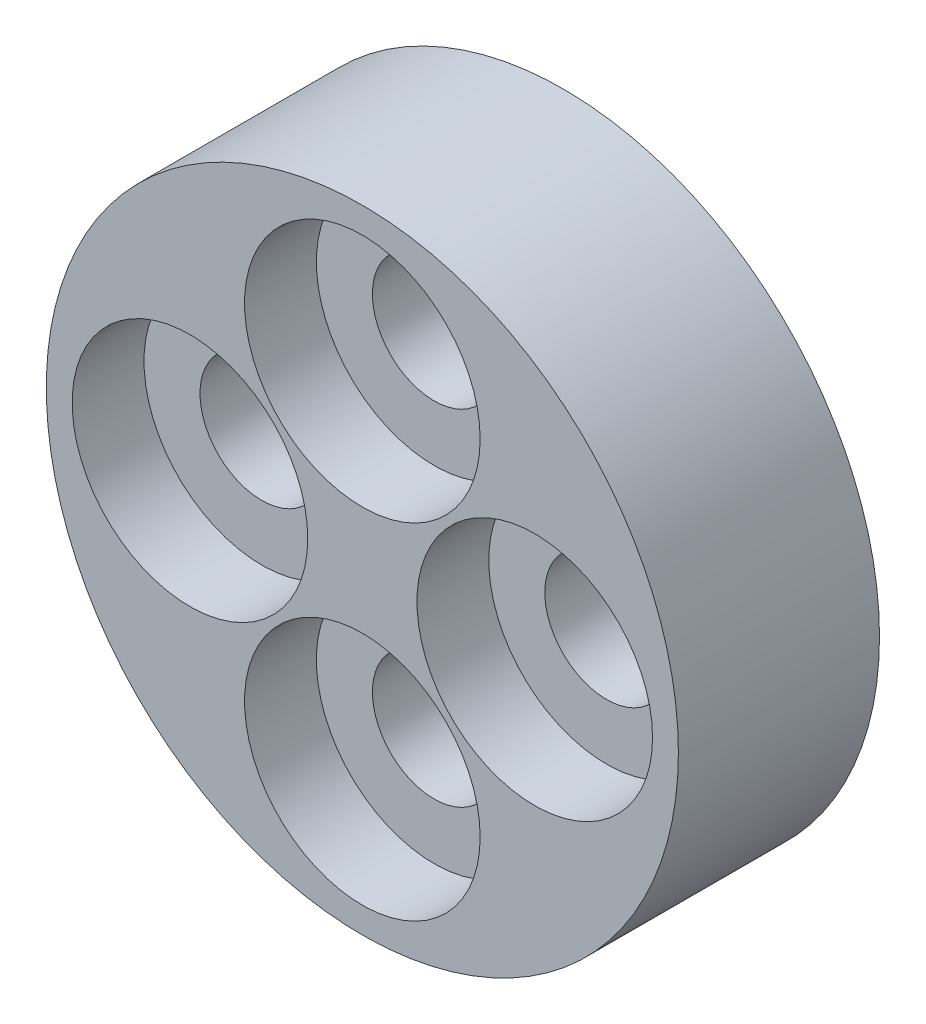
ISO-10303-21;
HEADER;
FILE_DESCRIPTION(('STEP AP214'),'2;1');
FILE_NAME('part.step','',(''),(''),'','','');
FILE_SCHEMA(('AUTOMOTIVE_DESIGN { 1 0 10303 214 1 1 1 1 }'));
ENDSEC;
DATA;
#1=APPLICATION_CONTEXT('core data for automotive mechanical design processes');
#2=APPLICATION_PROTOCOL_DEFINITION('international standard','automotive_design',2000,#1);
#3=PRODUCT_CONTEXT('',#1,'mechanical');
#4=PRODUCT('Part','Part','',(#3));
#5=PRODUCT_RELATED_PRODUCT_CATEGORY('part','',(#4));
#6=PRODUCT_DEFINITION_FORMATION('','',#4);
#7=PRODUCT_DEFINITION_CONTEXT('part definition',#1,'design');
#8=PRODUCT_DEFINITION('design','',#6,#7);
#9=PRODUCT_DEFINITION_SHAPE('','',#8);
#10=(LENGTH_UNIT() NAMED_UNIT(*) SI_UNIT(.MILLI.,.METRE.));
#11=(NAMED_UNIT(*) PLANE_ANGLE_UNIT() SI_UNIT($,.RADIAN.));
#12=(NAMED_UNIT(*) SI_UNIT($,.STERADIAN.) SOLID_ANGLE_UNIT());
#13=UNCERTAINTY_MEASURE_WITH_UNIT(LENGTH_MEASURE(1.E-05),#10,'distance_accuracy_value','');
#14=(GEOMETRIC_REPRESENTATION_CONTEXT(3) GLOBAL_UNCERTAINTY_ASSIGNED_CONTEXT((#13)) GLOBAL_UNIT_ASSIGNED_CONTEXT((#10,
#11,#12)) REPRESENTATION_CONTEXT('',''));
#15=CARTESIAN_POINT('',(0.,0.,0.));
#16=DIRECTION('',(0.,0.,1.));
#17=DIRECTION('',(1.,0.,0.));
#18=AXIS2_PLACEMENT_3D('',#15,#16,#17);
#19=CARTESIAN_POINT('',(0.,0.,7.));
#20=DIRECTION('',(0.,0.,-1.));
#21=DIRECTION('',(-1.,0.,0.));
#22=AXIS2_PLACEMENT_3D('',#19,#20,#21);
#23=CYLINDRICAL_SURFACE('',#22,11.);
#24=CARTESIAN_POINT('',(0.,0.,7.));
#25=DIRECTION('',(0.,0.,1.));
#26=DIRECTION('',(1.,0.,0.));
#27=AXIS2_PLACEMENT_3D('',#24,#25,#26);
#28=CIRCLE('',#27,11.);
#29=CARTESIAN_POINT('',(11.,0.,7.));
#30=VERTEX_POINT('',#29);
#31=EDGE_CURVE('E10',#30,#30,#28,.T.);
#32=ORIENTED_EDGE('',*,*,#31,.F.);
#33=EDGE_LOOP('',(#32));
#34=FACE_BOUND('',#33,.T.);
#35=CARTESIAN_POINT('',(0.,0.,0.));
#36=DIRECTION('',(0.,0.,1.));
#37=DIRECTION('',(1.,0.,0.));
#38=AXIS2_PLACEMENT_3D('',#35,#36,#37);
#39=CIRCLE('',#38,11.);
#40=CARTESIAN_POINT('',(11.,0.,0.));
#41=VERTEX_POINT('',#40);
#42=EDGE_CURVE('E40',#41,#41,#39,.T.);
#43=ORIENTED_EDGE('',*,*,#42,.T.);
#44=EDGE_LOOP('',(#43));
#45=FACE_BOUND('',#44,.T.);
#46=ADVANCED_FACE('F33',(#34,#45),#23,.T.);
#47=CARTESIAN_POINT('',(0.,0.,7.));
#48=DIRECTION('',(0.,0.,1.));
#49=DIRECTION('',(1.,0.,0.));
#50=AXIS2_PLACEMENT_3D('',#47,#48,#49);
#51=PLANE('',#50);
#52=CARTESIAN_POINT('',(0.,-6.,7.));
#53=DIRECTION('',(0.,0.,1.));
#54=DIRECTION('',(1.,0.,0.));
#55=AXIS2_PLACEMENT_3D('',#52,#53,#54);
#56=CIRCLE('',#55,4.1);
#57=CARTESIAN_POINT('',(4.1,-6.,7.));
#58=VERTEX_POINT('',#57);
#59=EDGE_CURVE('E71',#58,#58,#56,.T.);
#60=ORIENTED_EDGE('',*,*,#59,.F.);
#61=EDGE_LOOP('',(#60));
#62=FACE_BOUND('',#61,.T.);
#63=CARTESIAN_POINT('',(6.,0.,7.));
#64=DIRECTION('',(0.,0.,1.));
#65=DIRECTION('',(1.,0.,0.));
#66=AXIS2_PLACEMENT_3D('',#63,#64,#65);
#67=CIRCLE('',#66,4.1);
#68=CARTESIAN_POINT('',(10.1,0.,7.));
#69=VERTEX_POINT('',#68);
#70=EDGE_CURVE('E78',#69,#69,#67,.T.);
#71=ORIENTED_EDGE('',*,*,#70,.F.);
#72=EDGE_LOOP('',(#71));
#73=FACE_BOUND('',#72,.T.);
#74=CARTESIAN_POINT('',(-6.,0.,7.));
#75=DIRECTION('',(0.,0.,1.));
#76=DIRECTION('',(1.,0.,0.));
#77=AXIS2_PLACEMENT_3D('',#74,#75,#76);
#78=CIRCLE('',#77,4.1);
#79=CARTESIAN_POINT('',(-1.9,0.,7.));
#80=VERTEX_POINT('',#79);
#81=EDGE_CURVE('E62',#80,#80,#78,.T.);
#82=ORIENTED_EDGE('',*,*,#81,.F.);
#83=EDGE_LOOP('',(#82));
#84=FACE_BOUND('',#83,.T.);
#85=CARTESIAN_POINT('',(0.,6.,7.));
#86=DIRECTION('',(0.,0.,1.));
#87=DIRECTION('',(1.,0.,0.));
#88=AXIS2_PLACEMENT_3D('',#85,#86,#87);
#89=CIRCLE('',#88,4.1);
#90=CARTESIAN_POINT('',(4.1,6.,7.));
#91=VERTEX_POINT('',#90);
#92=EDGE_CURVE('E48',#91,#91,#89,.T.);
#93=ORIENTED_EDGE('',*,*,#92,.F.);
#94=EDGE_LOOP('',(#93));
#95=FACE_BOUND('',#94,.T.);
#96=ORIENTED_EDGE('',*,*,#31,.T.);
#97=EDGE_LOOP('',(#96));
#98=FACE_BOUND('',#97,.T.);
#99=ADVANCED_FACE('F93',(#62,#73,#84,#95,#98),#51,.T.);
#100=CARTESIAN_POINT('',(0.,0.,0.));
#101=DIRECTION('',(0.,0.,1.));
#102=DIRECTION('',(1.,0.,0.));
#103=AXIS2_PLACEMENT_3D('',#100,#101,#102);
#104=PLANE('',#103);
#105=CARTESIAN_POINT('',(0.,-6.,0.));
#106=DIRECTION('',(0.,0.,1.));
#107=DIRECTION('',(1.,0.,0.));
#108=AXIS2_PLACEMENT_3D('',#105,#106,#107);
#109=CIRCLE('',#108,2.15);
#110=CARTESIAN_POINT('',(2.15,-6.,0.));
#111=VERTEX_POINT('',#110);
#112=EDGE_CURVE('E36',#111,#111,#109,.T.);
#113=ORIENTED_EDGE('',*,*,#112,.T.);
#114=EDGE_LOOP('',(#113));
#115=FACE_BOUND('',#114,.T.);
#116=CARTESIAN_POINT('',(-6.,0.,0.));
#117=DIRECTION('',(0.,0.,1.));
#118=DIRECTION('',(1.,0.,0.));
#119=AXIS2_PLACEMENT_3D('',#116,#117,#118);
#120=CIRCLE('',#119,2.15);
#121=CARTESIAN_POINT('',(-3.85,0.,0.));
#122=VERTEX_POINT('',#121);
#123=EDGE_CURVE('E57',#122,#122,#120,.T.);
#124=ORIENTED_EDGE('',*,*,#123,.T.);
#125=EDGE_LOOP('',(#124));
#126=FACE_BOUND('',#125,.T.);
#127=CARTESIAN_POINT('',(0.,6.,0.));
#128=DIRECTION('',(0.,0.,1.));
#129=DIRECTION('',(1.,0.,0.));
#130=AXIS2_PLACEMENT_3D('',#127,#128,#129);
#131=CIRCLE('',#130,2.15);
#132=CARTESIAN_POINT('',(2.15000000000004,6.,0.));
#133=VERTEX_POINT('',#132);
#134=EDGE_CURVE('E54',#133,#133,#131,.T.);
#135=ORIENTED_EDGE('',*,*,#134,.T.);
#136=EDGE_LOOP('',(#135));
#137=FACE_BOUND('',#136,.T.);
#138=CARTESIAN_POINT('',(6.,0.,0.));
#139=DIRECTION('',(0.,0.,1.));
#140=DIRECTION('',(1.,0.,0.));
#141=AXIS2_PLACEMENT_3D('',#138,#139,#140);
#142=CIRCLE('',#141,2.15);
#143=CARTESIAN_POINT('',(8.15,0.,0.));
#144=VERTEX_POINT('',#143);
#145=EDGE_CURVE('E51',#144,#144,#142,.T.);
#146=ORIENTED_EDGE('',*,*,#145,.T.);
#147=EDGE_LOOP('',(#146));
#148=FACE_BOUND('',#147,.T.);
#149=ORIENTED_EDGE('',*,*,#42,.F.);
#150=EDGE_LOOP('',(#149));
#151=FACE_BOUND('',#150,.T.);
#152=ADVANCED_FACE('F95',(#115,#126,#137,#148,#151),#104,.F.);
#153=CARTESIAN_POINT('',(0.,6.,4.5));
#154=DIRECTION('',(0.,0.,1.));
#155=DIRECTION('',(1.,0.,0.));
#156=AXIS2_PLACEMENT_3D('',#153,#154,#155);
#157=CYLINDRICAL_SURFACE('',#156,4.1);
#158=CARTESIAN_POINT('',(0.,6.,4.5));
#159=DIRECTION('',(0.,0.,1.));
#160=DIRECTION('',(1.,0.,0.));
#161=AXIS2_PLACEMENT_3D('',#158,#159,#160);
#162=CIRCLE('',#161,4.1);
#163=CARTESIAN_POINT('',(4.1,6.,4.5));
#164=VERTEX_POINT('',#163);
#165=EDGE_CURVE('E45',#164,#164,#162,.T.);
#166=ORIENTED_EDGE('',*,*,#165,.F.);
#167=EDGE_LOOP('',(#166));
#168=FACE_BOUND('',#167,.T.);
#169=ORIENTED_EDGE('',*,*,#92,.T.);
#170=EDGE_LOOP('',(#169));
#171=FACE_BOUND('',#170,.T.);
#172=ADVANCED_FACE('F91',(#168,#171),#157,.F.);
#173=CARTESIAN_POINT('',(0.,6.,4.5));
#174=DIRECTION('',(0.,0.,1.));
#175=DIRECTION('',(1.,0.,0.));
#176=AXIS2_PLACEMENT_3D('',#173,#174,#175);
#177=PLANE('',#176);
#178=CARTESIAN_POINT('',(0.,6.,4.5));
#179=DIRECTION('',(0.,0.,1.));
#180=DIRECTION('',(1.,0.,0.));
#181=AXIS2_PLACEMENT_3D('',#178,#179,#180);
#182=CIRCLE('',#181,2.15);
#183=CARTESIAN_POINT('',(2.15000000000004,6.,4.5));
#184=VERTEX_POINT('',#183);
#185=EDGE_CURVE('E160',#184,#184,#182,.T.);
#186=ORIENTED_EDGE('',*,*,#185,.F.);
#187=EDGE_LOOP('',(#186));
#188=FACE_BOUND('',#187,.T.);
#189=ORIENTED_EDGE('',*,*,#165,.T.);
#190=EDGE_LOOP('',(#189));
#191=FACE_BOUND('',#190,.T.);
#192=ADVANCED_FACE('F108',(#188,#191),#177,.T.);
#193=CARTESIAN_POINT('',(-6.,0.,4.5));
#194=DIRECTION('',(0.,0.,1.));
#195=DIRECTION('',(1.,0.,0.));
#196=AXIS2_PLACEMENT_3D('',#193,#194,#195);
#197=CYLINDRICAL_SURFACE('',#196,4.1);
#198=CARTESIAN_POINT('',(-6.,0.,4.5));
#199=DIRECTION('',(0.,0.,1.));
#200=DIRECTION('',(1.,0.,0.));
#201=AXIS2_PLACEMENT_3D('',#198,#199,#200);
#202=CIRCLE('',#201,4.1);
#203=CARTESIAN_POINT('',(-1.9,0.,4.5));
#204=VERTEX_POINT('',#203);
#205=EDGE_CURVE('E66',#204,#204,#202,.T.);
#206=ORIENTED_EDGE('',*,*,#205,.F.);
#207=EDGE_LOOP('',(#206));
#208=FACE_BOUND('',#207,.T.);
#209=ORIENTED_EDGE('',*,*,#81,.T.);
#210=EDGE_LOOP('',(#209));
#211=FACE_BOUND('',#210,.T.);
#212=ADVANCED_FACE('F112',(#208,#211),#197,.F.);
#213=CARTESIAN_POINT('',(-6.,0.,4.5));
#214=DIRECTION('',(0.,0.,1.));
#215=DIRECTION('',(1.,0.,0.));
#216=AXIS2_PLACEMENT_3D('',#213,#214,#215);
#217=PLANE('',#216);
#218=CARTESIAN_POINT('',(-6.,0.,4.5));
#219=DIRECTION('',(0.,0.,1.));
#220=DIRECTION('',(1.,0.,0.));
#221=AXIS2_PLACEMENT_3D('',#218,#219,#220);
#222=CIRCLE('',#221,2.15);
#223=CARTESIAN_POINT('',(-3.85,0.,4.5));
#224=VERTEX_POINT('',#223);
#225=EDGE_CURVE('E157',#224,#224,#222,.T.);
#226=ORIENTED_EDGE('',*,*,#225,.F.);
#227=EDGE_LOOP('',(#226));
#228=FACE_BOUND('',#227,.T.);
#229=ORIENTED_EDGE('',*,*,#205,.T.);
#230=EDGE_LOOP('',(#229));
#231=FACE_BOUND('',#230,.T.);
#232=ADVANCED_FACE('F118',(#228,#231),#217,.T.);
#233=CARTESIAN_POINT('',(6.,0.,4.5));
#234=DIRECTION('',(0.,0.,1.));
#235=DIRECTION('',(1.,0.,0.));
#236=AXIS2_PLACEMENT_3D('',#233,#234,#235);
#237=CYLINDRICAL_SURFACE('',#236,4.1);
#238=CARTESIAN_POINT('',(6.,0.,4.5));
#239=DIRECTION('',(0.,0.,1.));
#240=DIRECTION('',(1.,0.,0.));
#241=AXIS2_PLACEMENT_3D('',#238,#239,#240);
#242=CIRCLE('',#241,4.1);
#243=CARTESIAN_POINT('',(10.1,0.,4.5));
#244=VERTEX_POINT('',#243);
#245=EDGE_CURVE('E81',#244,#244,#242,.T.);
#246=ORIENTED_EDGE('',*,*,#245,.F.);
#247=EDGE_LOOP('',(#246));
#248=FACE_BOUND('',#247,.T.);
#249=ORIENTED_EDGE('',*,*,#70,.T.);
#250=EDGE_LOOP('',(#249));
#251=FACE_BOUND('',#250,.T.);
#252=ADVANCED_FACE('F114',(#248,#251),#237,.F.);
#253=CARTESIAN_POINT('',(6.,0.,4.5));
#254=DIRECTION('',(0.,0.,1.));
#255=DIRECTION('',(1.,0.,0.));
#256=AXIS2_PLACEMENT_3D('',#253,#254,#255);
#257=PLANE('',#256);
#258=CARTESIAN_POINT('',(6.,0.,4.5));
#259=DIRECTION('',(0.,0.,1.));
#260=DIRECTION('',(1.,0.,0.));
#261=AXIS2_PLACEMENT_3D('',#258,#259,#260);
#262=CIRCLE('',#261,2.15);
#263=CARTESIAN_POINT('',(8.15,0.,4.5));
#264=VERTEX_POINT('',#263);
#265=EDGE_CURVE('E164',#264,#264,#262,.T.);
#266=ORIENTED_EDGE('',*,*,#265,.F.);
#267=EDGE_LOOP('',(#266));
#268=FACE_BOUND('',#267,.T.);
#269=ORIENTED_EDGE('',*,*,#245,.T.);
#270=EDGE_LOOP('',(#269));
#271=FACE_BOUND('',#270,.T.);
#272=ADVANCED_FACE('F117',(#268,#271),#257,.T.);
#273=CARTESIAN_POINT('',(0.,-6.,4.5));
#274=DIRECTION('',(0.,0.,1.));
#275=DIRECTION('',(1.,0.,0.));
#276=AXIS2_PLACEMENT_3D('',#273,#274,#275);
#277=CYLINDRICAL_SURFACE('',#276,4.1);
#278=CARTESIAN_POINT('',(0.,-6.,4.5));
#279=DIRECTION('',(0.,0.,1.));
#280=DIRECTION('',(1.,0.,0.));
#281=AXIS2_PLACEMENT_3D('',#278,#279,#280);
#282=CIRCLE('',#281,4.1);
#283=CARTESIAN_POINT('',(4.1,-6.,4.5));
#284=VERTEX_POINT('',#283);
#285=EDGE_CURVE('E75',#284,#284,#282,.T.);
#286=ORIENTED_EDGE('',*,*,#285,.F.);
#287=EDGE_LOOP('',(#286));
#288=FACE_BOUND('',#287,.T.);
#289=ORIENTED_EDGE('',*,*,#59,.T.);
#290=EDGE_LOOP('',(#289));
#291=FACE_BOUND('',#290,.T.);
#292=ADVANCED_FACE('F122',(#288,#291),#277,.F.);
#293=CARTESIAN_POINT('',(0.,-6.,4.5));
#294=DIRECTION('',(0.,0.,1.));
#295=DIRECTION('',(1.,0.,0.));
#296=AXIS2_PLACEMENT_3D('',#293,#294,#295);
#297=PLANE('',#296);
#298=CARTESIAN_POINT('',(0.,-6.,4.5));
#299=DIRECTION('',(0.,0.,1.));
#300=DIRECTION('',(1.,0.,0.));
#301=AXIS2_PLACEMENT_3D('',#298,#299,#300);
#302=CIRCLE('',#301,2.15);
#303=CARTESIAN_POINT('',(2.15,-6.,4.5));
#304=VERTEX_POINT('',#303);
#305=EDGE_CURVE('E55',#304,#304,#302,.T.);
#306=ORIENTED_EDGE('',*,*,#305,.F.);
#307=EDGE_LOOP('',(#306));
#308=FACE_BOUND('',#307,.T.);
#309=ORIENTED_EDGE('',*,*,#285,.T.);
#310=EDGE_LOOP('',(#309));
#311=FACE_BOUND('',#310,.T.);
#312=ADVANCED_FACE('F126',(#308,#311),#297,.T.);
#313=CARTESIAN_POINT('',(6.,0.,-5.5));
#314=DIRECTION('',(0.,0.,1.));
#315=DIRECTION('',(1.,0.,0.));
#316=AXIS2_PLACEMENT_3D('',#313,#314,#315);
#317=CYLINDRICAL_SURFACE('',#316,2.15);
#318=ORIENTED_EDGE('',*,*,#265,.T.);
#319=EDGE_LOOP('',(#318));
#320=FACE_BOUND('',#319,.T.);
#321=ORIENTED_EDGE('',*,*,#145,.F.);
#322=EDGE_LOOP('',(#321));
#323=FACE_BOUND('',#322,.T.);
#324=ADVANCED_FACE('F130',(#320,#323),#317,.F.);
#325=CARTESIAN_POINT('',(0.,6.,-5.5));
#326=DIRECTION('',(0.,0.,1.));
#327=DIRECTION('',(1.,0.,0.));
#328=AXIS2_PLACEMENT_3D('',#325,#326,#327);
#329=CYLINDRICAL_SURFACE('',#328,2.15);
#330=ORIENTED_EDGE('',*,*,#185,.T.);
#331=EDGE_LOOP('',(#330));
#332=FACE_BOUND('',#331,.T.);
#333=ORIENTED_EDGE('',*,*,#134,.F.);
#334=EDGE_LOOP('',(#333));
#335=FACE_BOUND('',#334,.T.);
#336=ADVANCED_FACE('F140',(#332,#335),#329,.F.);
#337=CARTESIAN_POINT('',(-6.,0.,-5.5));
#338=DIRECTION('',(0.,0.,1.));
#339=DIRECTION('',(1.,0.,0.));
#340=AXIS2_PLACEMENT_3D('',#337,#338,#339);
#341=CYLINDRICAL_SURFACE('',#340,2.15);
#342=ORIENTED_EDGE('',*,*,#225,.T.);
#343=EDGE_LOOP('',(#342));
#344=FACE_BOUND('',#343,.T.);
#345=ORIENTED_EDGE('',*,*,#123,.F.);
#346=EDGE_LOOP('',(#345));
#347=FACE_BOUND('',#346,.T.);
#348=ADVANCED_FACE('F144',(#344,#347),#341,.F.);
#349=CARTESIAN_POINT('',(0.,-6.,-5.5));
#350=DIRECTION('',(0.,0.,1.));
#351=DIRECTION('',(1.,0.,0.));
#352=AXIS2_PLACEMENT_3D('',#349,#350,#351);
#353=CYLINDRICAL_SURFACE('',#352,2.15);
#354=ORIENTED_EDGE('',*,*,#305,.T.);
#355=EDGE_LOOP('',(#354));
#356=FACE_BOUND('',#355,.T.);
#357=ORIENTED_EDGE('',*,*,#112,.F.);
#358=EDGE_LOOP('',(#357));
#359=FACE_BOUND('',#358,.T.);
#360=ADVANCED_FACE('F148',(#356,#359),#353,.F.);
#361=CLOSED_SHELL('',(#46,#99,#152,#172,#192,#212,#232,#252,#272,#292,#312,#324,#336,#348,#360));
#362=MANIFOLD_SOLID_BREP('B2',#361);
#363=ADVANCED_BREP_SHAPE_REPRESENTATION('',(#18,#362),#14);
#364=SHAPE_DEFINITION_REPRESENTATION(#9,#363);
ENDSEC;
END-ISO-10303-21;
